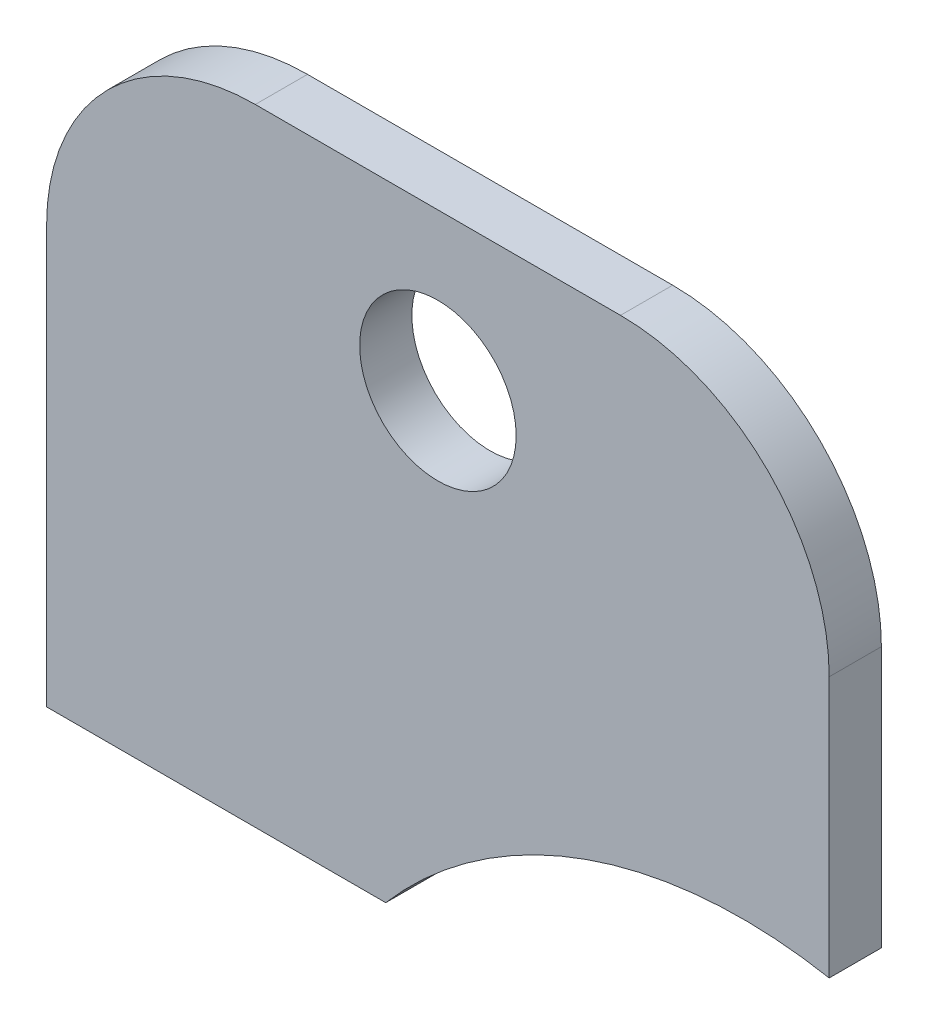
ISO-10303-21;
HEADER;
FILE_DESCRIPTION(('STEP AP214'),'2;1');
FILE_NAME('part.step','',(''),(''),'','','');
FILE_SCHEMA(('AUTOMOTIVE_DESIGN { 1 0 10303 214 1 1 1 1 }'));
ENDSEC;
DATA;
#1=APPLICATION_CONTEXT('core data for automotive mechanical design processes');
#2=APPLICATION_PROTOCOL_DEFINITION('international standard','automotive_design',2000,#1);
#3=PRODUCT_CONTEXT('',#1,'mechanical');
#4=PRODUCT('Part','Part','',(#3));
#5=PRODUCT_RELATED_PRODUCT_CATEGORY('part','',(#4));
#6=PRODUCT_DEFINITION_FORMATION('','',#4);
#7=PRODUCT_DEFINITION_CONTEXT('part definition',#1,'design');
#8=PRODUCT_DEFINITION('design','',#6,#7);
#9=PRODUCT_DEFINITION_SHAPE('','',#8);
#10=(LENGTH_UNIT() NAMED_UNIT(*) SI_UNIT(.MILLI.,.METRE.));
#11=(NAMED_UNIT(*) PLANE_ANGLE_UNIT() SI_UNIT($,.RADIAN.));
#12=(NAMED_UNIT(*) SI_UNIT($,.STERADIAN.) SOLID_ANGLE_UNIT());
#13=UNCERTAINTY_MEASURE_WITH_UNIT(LENGTH_MEASURE(1.E-05),#10,'distance_accuracy_value','');
#14=(GEOMETRIC_REPRESENTATION_CONTEXT(3) GLOBAL_UNCERTAINTY_ASSIGNED_CONTEXT((#13)) GLOBAL_UNIT_ASSIGNED_CONTEXT((#10,
#11,#12)) REPRESENTATION_CONTEXT('',''));
#15=CARTESIAN_POINT('',(0.,0.,0.));
#16=DIRECTION('',(0.,0.,1.));
#17=DIRECTION('',(1.,0.,0.));
#18=AXIS2_PLACEMENT_3D('',#15,#16,#17);
#19=CARTESIAN_POINT('',(1492.71785682144,-35.4999999999995,2.));
#20=DIRECTION('',(0.,0.,-1.));
#21=DIRECTION('',(-1.,0.,0.));
#22=AXIS2_PLACEMENT_3D('',#19,#20,#21);
#23=CYLINDRICAL_SURFACE('',#22,8.);
#24=DIRECTION('',(0.,0.,-1.));
#25=VECTOR('',#24,1.);
#26=CARTESIAN_POINT('',(1492.71785682144,-27.4999999999995,2.));
#27=LINE('',#26,#25);
#28=CARTESIAN_POINT('',(1492.71785682144,-27.4999999999995,2.));
#29=VERTEX_POINT('',#28);
#30=CARTESIAN_POINT('',(1492.71785682144,-27.4999999999995,0.));
#31=VERTEX_POINT('',#30);
#32=EDGE_CURVE('E131',#29,#31,#27,.T.);
#33=ORIENTED_EDGE('',*,*,#32,.F.);
#34=CARTESIAN_POINT('',(1492.71785682144,-35.4999999999995,2.));
#35=DIRECTION('',(0.,0.,-1.));
#36=DIRECTION('',(-1.,0.,0.));
#37=AXIS2_PLACEMENT_3D('',#34,#35,#36);
#38=CIRCLE('',#37,8.);
#39=CARTESIAN_POINT('',(1500.71785682144,-35.4999999999995,2.));
#40=VERTEX_POINT('',#39);
#41=EDGE_CURVE('E41',#40,#29,#38,.F.);
#42=ORIENTED_EDGE('',*,*,#41,.F.);
#43=DIRECTION('',(0.,0.,-1.));
#44=VECTOR('',#43,1.);
#45=CARTESIAN_POINT('',(1500.71785682144,-35.4999999999995,2.));
#46=LINE('',#45,#44);
#47=CARTESIAN_POINT('',(1500.71785682144,-35.4999999999995,0.));
#48=VERTEX_POINT('',#47);
#49=EDGE_CURVE('E96',#48,#40,#46,.F.);
#50=ORIENTED_EDGE('',*,*,#49,.F.);
#51=CARTESIAN_POINT('',(1492.71785682144,-35.4999999999995,0.));
#52=DIRECTION('',(0.,0.,-1.));
#53=DIRECTION('',(-1.,0.,0.));
#54=AXIS2_PLACEMENT_3D('',#51,#52,#53);
#55=CIRCLE('',#54,8.);
#56=EDGE_CURVE('E11',#31,#48,#55,.T.);
#57=ORIENTED_EDGE('',*,*,#56,.F.);
#58=EDGE_LOOP('',(#33,#42,#50,#57));
#59=FACE_BOUND('',#58,.T.);
#60=ADVANCED_FACE('F34',(#59),#23,.T.);
#61=CARTESIAN_POINT('',(1478.71785682144,-35.4999999999995,2.));
#62=DIRECTION('',(0.,0.,-1.));
#63=DIRECTION('',(-1.,0.,0.));
#64=AXIS2_PLACEMENT_3D('',#61,#62,#63);
#65=CYLINDRICAL_SURFACE('',#64,8.);
#66=DIRECTION('',(0.,0.,-1.));
#67=VECTOR('',#66,1.);
#68=CARTESIAN_POINT('',(1470.71785682144,-35.4999999999995,2.));
#69=LINE('',#68,#67);
#70=CARTESIAN_POINT('',(1470.71785682144,-35.4999999999995,2.));
#71=VERTEX_POINT('',#70);
#72=CARTESIAN_POINT('',(1470.71785682144,-35.4999999999995,0.));
#73=VERTEX_POINT('',#72);
#74=EDGE_CURVE('E113',#71,#73,#69,.T.);
#75=ORIENTED_EDGE('',*,*,#74,.F.);
#76=CARTESIAN_POINT('',(1478.71785682144,-35.4999999999995,2.));
#77=DIRECTION('',(0.,0.,-1.));
#78=DIRECTION('',(-1.,0.,0.));
#79=AXIS2_PLACEMENT_3D('',#76,#77,#78);
#80=CIRCLE('',#79,8.);
#81=CARTESIAN_POINT('',(1478.71785682144,-27.4999999999995,2.));
#82=VERTEX_POINT('',#81);
#83=EDGE_CURVE('E126',#82,#71,#80,.F.);
#84=ORIENTED_EDGE('',*,*,#83,.F.);
#85=DIRECTION('',(0.,0.,-1.));
#86=VECTOR('',#85,1.);
#87=CARTESIAN_POINT('',(1478.71785682144,-27.4999999999995,2.));
#88=LINE('',#87,#86);
#89=CARTESIAN_POINT('',(1478.71785682144,-27.4999999999995,0.));
#90=VERTEX_POINT('',#89);
#91=EDGE_CURVE('E117',#90,#82,#88,.F.);
#92=ORIENTED_EDGE('',*,*,#91,.F.);
#93=CARTESIAN_POINT('',(1478.71785682144,-35.4999999999995,0.));
#94=DIRECTION('',(0.,0.,-1.));
#95=DIRECTION('',(-1.,0.,0.));
#96=AXIS2_PLACEMENT_3D('',#93,#94,#95);
#97=CIRCLE('',#96,8.);
#98=EDGE_CURVE('E128',#73,#90,#97,.T.);
#99=ORIENTED_EDGE('',*,*,#98,.F.);
#100=EDGE_LOOP('',(#75,#84,#92,#99));
#101=FACE_BOUND('',#100,.T.);
#102=ADVANCED_FACE('F163',(#101),#65,.T.);
#103=CARTESIAN_POINT('',(1497.40333951539,-63.1922009661846,2.));
#104=DIRECTION('',(0.,0.,-1.));
#105=DIRECTION('',(-1.,0.,0.));
#106=AXIS2_PLACEMENT_3D('',#103,#104,#105);
#107=CYLINDRICAL_SURFACE('',#106,18.);
#108=CARTESIAN_POINT('',(1497.40333951539,-63.1922009661846,0.));
#109=DIRECTION('',(0.,0.,-1.));
#110=DIRECTION('',(-1.,0.,0.));
#111=AXIS2_PLACEMENT_3D('',#108,#109,#110);
#112=CIRCLE('',#111,18.);
#113=CARTESIAN_POINT('',(1483.71785682144,-51.4999999999995,0.));
#114=VERTEX_POINT('',#113);
#115=CARTESIAN_POINT('',(1500.71785682144,-45.4999999999995,0.));
#116=VERTEX_POINT('',#115);
#117=EDGE_CURVE('E112',#114,#116,#112,.T.);
#118=ORIENTED_EDGE('',*,*,#117,.T.);
#119=DIRECTION('',(0.,0.,-1.));
#120=VECTOR('',#119,1.);
#121=CARTESIAN_POINT('',(1500.71785682144,-45.4999999999995,2.));
#122=LINE('',#121,#120);
#123=CARTESIAN_POINT('',(1500.71785682144,-45.4999999999995,2.));
#124=VERTEX_POINT('',#123);
#125=EDGE_CURVE('E94',#124,#116,#122,.T.);
#126=ORIENTED_EDGE('',*,*,#125,.F.);
#127=CARTESIAN_POINT('',(1497.40333951539,-63.1922009661846,2.));
#128=DIRECTION('',(0.,0.,-1.));
#129=DIRECTION('',(-1.,0.,0.));
#130=AXIS2_PLACEMENT_3D('',#127,#128,#129);
#131=CIRCLE('',#130,18.);
#132=CARTESIAN_POINT('',(1483.71785682144,-51.4999999999995,2.));
#133=VERTEX_POINT('',#132);
#134=EDGE_CURVE('E99',#133,#124,#131,.T.);
#135=ORIENTED_EDGE('',*,*,#134,.F.);
#136=DIRECTION('',(0.,0.,-1.));
#137=VECTOR('',#136,1.);
#138=CARTESIAN_POINT('',(1483.71785682144,-51.4999999999995,2.));
#139=LINE('',#138,#137);
#140=EDGE_CURVE('E120',#133,#114,#139,.T.);
#141=ORIENTED_EDGE('',*,*,#140,.T.);
#142=EDGE_LOOP('',(#118,#126,#135,#141));
#143=FACE_BOUND('',#142,.T.);
#144=ADVANCED_FACE('F110',(#143),#107,.F.);
#145=CARTESIAN_POINT('',(1500.71785682144,-27.4999999999995,2.));
#146=DIRECTION('',(-1.,0.,0.));
#147=DIRECTION('',(0.,0.,1.));
#148=AXIS2_PLACEMENT_3D('',#145,#146,#147);
#149=PLANE('',#148);
#150=DIRECTION('',(0.,1.,0.));
#151=VECTOR('',#150,1.);
#152=CARTESIAN_POINT('',(1500.71785682144,-27.4999999999995,0.));
#153=LINE('',#152,#151);
#154=EDGE_CURVE('E145',#116,#48,#153,.T.);
#155=ORIENTED_EDGE('',*,*,#154,.T.);
#156=ORIENTED_EDGE('',*,*,#49,.T.);
#157=DIRECTION('',(0.,1.,0.));
#158=VECTOR('',#157,1.);
#159=CARTESIAN_POINT('',(1500.71785682144,-27.4999999999995,2.));
#160=LINE('',#159,#158);
#161=EDGE_CURVE('E89',#124,#40,#160,.T.);
#162=ORIENTED_EDGE('',*,*,#161,.F.);
#163=ORIENTED_EDGE('',*,*,#125,.T.);
#164=EDGE_LOOP('',(#155,#156,#162,#163));
#165=FACE_BOUND('',#164,.T.);
#166=ADVANCED_FACE('F92',(#165),#149,.F.);
#167=CARTESIAN_POINT('',(1470.71785682144,-27.4999999999995,2.));
#168=DIRECTION('',(0.,-1.,0.));
#169=DIRECTION('',(1.,0.,0.));
#170=AXIS2_PLACEMENT_3D('',#167,#168,#169);
#171=PLANE('',#170);
#172=DIRECTION('',(-1.,0.,0.));
#173=VECTOR('',#172,1.);
#174=CARTESIAN_POINT('',(1470.71785682144,-27.4999999999995,2.));
#175=LINE('',#174,#173);
#176=EDGE_CURVE('E98',#29,#82,#175,.T.);
#177=ORIENTED_EDGE('',*,*,#176,.F.);
#178=ORIENTED_EDGE('',*,*,#32,.T.);
#179=DIRECTION('',(-1.,0.,0.));
#180=VECTOR('',#179,1.);
#181=CARTESIAN_POINT('',(1470.71785682144,-27.4999999999995,0.));
#182=LINE('',#181,#180);
#183=EDGE_CURVE('E148',#31,#90,#182,.T.);
#184=ORIENTED_EDGE('',*,*,#183,.T.);
#185=ORIENTED_EDGE('',*,*,#91,.T.);
#186=EDGE_LOOP('',(#177,#178,#184,#185));
#187=FACE_BOUND('',#186,.T.);
#188=ADVANCED_FACE('F137',(#187),#171,.F.);
#189=CARTESIAN_POINT('',(1470.71785682144,-27.4999999999995,2.));
#190=DIRECTION('',(1.,0.,0.));
#191=DIRECTION('',(0.,0.,-1.));
#192=AXIS2_PLACEMENT_3D('',#189,#190,#191);
#193=PLANE('',#192);
#194=DIRECTION('',(0.,-1.,0.));
#195=VECTOR('',#194,1.);
#196=CARTESIAN_POINT('',(1470.71785682144,-27.4999999999995,2.));
#197=LINE('',#196,#195);
#198=CARTESIAN_POINT('',(1470.71785682144,-51.4999999999995,2.));
#199=VERTEX_POINT('',#198);
#200=EDGE_CURVE('E139',#71,#199,#197,.T.);
#201=ORIENTED_EDGE('',*,*,#200,.F.);
#202=ORIENTED_EDGE('',*,*,#74,.T.);
#203=DIRECTION('',(0.,-1.,0.));
#204=VECTOR('',#203,1.);
#205=CARTESIAN_POINT('',(1470.71785682144,-27.4999999999995,0.));
#206=LINE('',#205,#204);
#207=CARTESIAN_POINT('',(1470.71785682144,-51.4999999999995,0.));
#208=VERTEX_POINT('',#207);
#209=EDGE_CURVE('E150',#73,#208,#206,.T.);
#210=ORIENTED_EDGE('',*,*,#209,.T.);
#211=DIRECTION('',(0.,0.,-1.));
#212=VECTOR('',#211,1.);
#213=CARTESIAN_POINT('',(1470.71785682144,-51.4999999999995,2.));
#214=LINE('',#213,#212);
#215=EDGE_CURVE('E114',#199,#208,#214,.T.);
#216=ORIENTED_EDGE('',*,*,#215,.F.);
#217=EDGE_LOOP('',(#201,#202,#210,#216));
#218=FACE_BOUND('',#217,.T.);
#219=ADVANCED_FACE('F160',(#218),#193,.F.);
#220=CARTESIAN_POINT('',(1470.71785682144,-51.4999999999995,2.));
#221=DIRECTION('',(0.,1.,0.));
#222=DIRECTION('',(0.,0.,1.));
#223=AXIS2_PLACEMENT_3D('',#220,#221,#222);
#224=PLANE('',#223);
#225=DIRECTION('',(1.,0.,0.));
#226=VECTOR('',#225,1.);
#227=CARTESIAN_POINT('',(1470.71785682144,-51.4999999999995,0.));
#228=LINE('',#227,#226);
#229=EDGE_CURVE('E108',#208,#114,#228,.T.);
#230=ORIENTED_EDGE('',*,*,#229,.T.);
#231=ORIENTED_EDGE('',*,*,#140,.F.);
#232=DIRECTION('',(1.,0.,0.));
#233=VECTOR('',#232,1.);
#234=CARTESIAN_POINT('',(1470.71785682144,-51.4999999999995,2.));
#235=LINE('',#234,#233);
#236=EDGE_CURVE('E104',#199,#133,#235,.T.);
#237=ORIENTED_EDGE('',*,*,#236,.F.);
#238=ORIENTED_EDGE('',*,*,#215,.T.);
#239=EDGE_LOOP('',(#230,#231,#237,#238));
#240=FACE_BOUND('',#239,.T.);
#241=ADVANCED_FACE('F156',(#240),#224,.F.);
#242=CARTESIAN_POINT('',(1497.40333951539,-63.1922009661846,2.));
#243=DIRECTION('',(0.,0.,-1.));
#244=DIRECTION('',(-1.,0.,0.));
#245=AXIS2_PLACEMENT_3D('',#242,#243,#244);
#246=PLANE('',#245);
#247=CARTESIAN_POINT('',(1485.71785682144,-33.4999999999995,2.));
#248=DIRECTION('',(0.,0.,1.));
#249=DIRECTION('',(1.,0.,0.));
#250=AXIS2_PLACEMENT_3D('',#247,#248,#249);
#251=CIRCLE('',#250,2.99999999999993);
#252=CARTESIAN_POINT('',(1488.71785682144,-33.4999999999995,2.));
#253=VERTEX_POINT('',#252);
#254=EDGE_CURVE('E195',#253,#253,#251,.T.);
#255=ORIENTED_EDGE('',*,*,#254,.F.);
#256=EDGE_LOOP('',(#255));
#257=FACE_BOUND('',#256,.T.);
#258=ORIENTED_EDGE('',*,*,#161,.T.);
#259=ORIENTED_EDGE('',*,*,#41,.T.);
#260=ORIENTED_EDGE('',*,*,#176,.T.);
#261=ORIENTED_EDGE('',*,*,#83,.T.);
#262=ORIENTED_EDGE('',*,*,#200,.T.);
#263=ORIENTED_EDGE('',*,*,#236,.T.);
#264=ORIENTED_EDGE('',*,*,#134,.T.);
#265=EDGE_LOOP('',(#258,#259,#260,#261,#262,#263,#264));
#266=FACE_BOUND('',#265,.T.);
#267=ADVANCED_FACE('F102',(#257,#266),#246,.F.);
#268=CARTESIAN_POINT('',(1497.40333951539,-63.1922009661846,0.));
#269=DIRECTION('',(0.,0.,-1.));
#270=DIRECTION('',(-1.,0.,0.));
#271=AXIS2_PLACEMENT_3D('',#268,#269,#270);
#272=PLANE('',#271);
#273=CARTESIAN_POINT('',(1485.71785682144,-33.4999999999995,0.));
#274=DIRECTION('',(0.,0.,1.));
#275=DIRECTION('',(1.,0.,0.));
#276=AXIS2_PLACEMENT_3D('',#273,#274,#275);
#277=CIRCLE('',#276,2.99999999999993);
#278=CARTESIAN_POINT('',(1488.71785682144,-33.4999999999995,0.));
#279=VERTEX_POINT('',#278);
#280=EDGE_CURVE('E146',#279,#279,#277,.T.);
#281=ORIENTED_EDGE('',*,*,#280,.T.);
#282=EDGE_LOOP('',(#281));
#283=FACE_BOUND('',#282,.T.);
#284=ORIENTED_EDGE('',*,*,#183,.F.);
#285=ORIENTED_EDGE('',*,*,#56,.T.);
#286=ORIENTED_EDGE('',*,*,#154,.F.);
#287=ORIENTED_EDGE('',*,*,#117,.F.);
#288=ORIENTED_EDGE('',*,*,#229,.F.);
#289=ORIENTED_EDGE('',*,*,#209,.F.);
#290=ORIENTED_EDGE('',*,*,#98,.T.);
#291=EDGE_LOOP('',(#284,#285,#286,#287,#288,#289,#290));
#292=FACE_BOUND('',#291,.T.);
#293=ADVANCED_FACE('F154',(#283,#292),#272,.T.);
#294=CARTESIAN_POINT('',(1485.71785682144,-33.4999999999995,0.));
#295=DIRECTION('',(0.,0.,1.));
#296=DIRECTION('',(1.,0.,0.));
#297=AXIS2_PLACEMENT_3D('',#294,#295,#296);
#298=CYLINDRICAL_SURFACE('',#297,2.99999999999993);
#299=ORIENTED_EDGE('',*,*,#280,.F.);
#300=EDGE_LOOP('',(#299));
#301=FACE_BOUND('',#300,.T.);
#302=ORIENTED_EDGE('',*,*,#254,.T.);
#303=EDGE_LOOP('',(#302));
#304=FACE_BOUND('',#303,.T.);
#305=ADVANCED_FACE('F181',(#301,#304),#298,.F.);
#306=CLOSED_SHELL('',(#60,#102,#144,#166,#188,#219,#241,#267,#293,#305));
#307=MANIFOLD_SOLID_BREP('B2',#306);
#308=ADVANCED_BREP_SHAPE_REPRESENTATION('',(#18,#307),#14);
#309=SHAPE_DEFINITION_REPRESENTATION(#9,#308);
ENDSEC;
END-ISO-10303-21;
